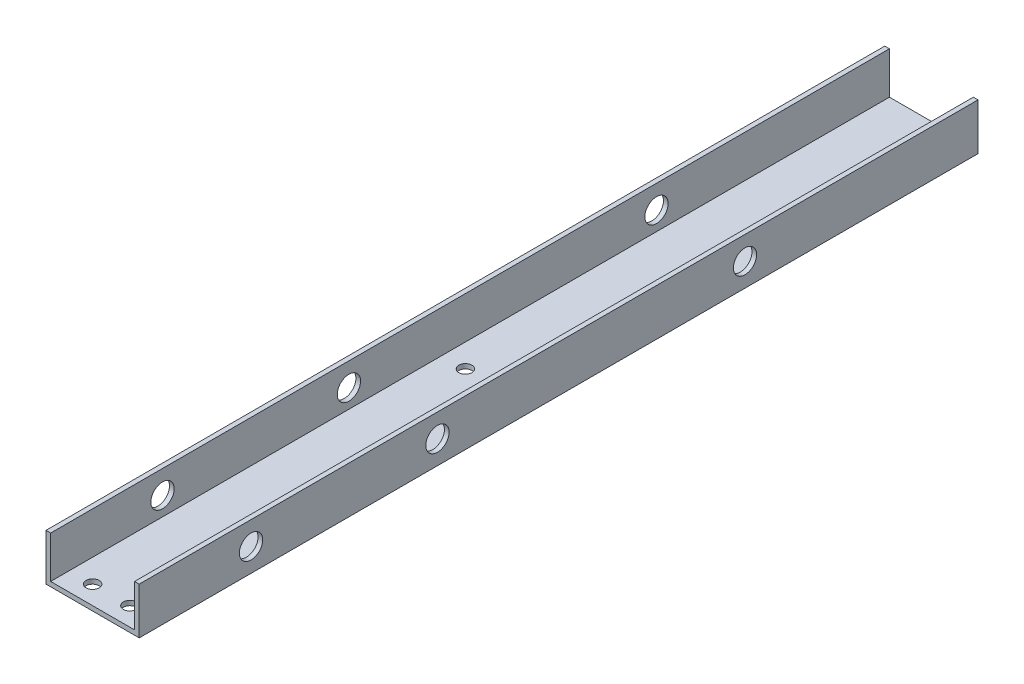
ISO-10303-21;
HEADER;
FILE_DESCRIPTION(('STEP AP214'),'2;1');
FILE_NAME('part.step','',(''),(''),'','','');
FILE_SCHEMA(('AUTOMOTIVE_DESIGN { 1 0 10303 214 1 1 1 1 }'));
ENDSEC;
DATA;
#1=APPLICATION_CONTEXT('core data for automotive mechanical design processes');
#2=APPLICATION_PROTOCOL_DEFINITION('international standard','automotive_design',2000,#1);
#3=PRODUCT_CONTEXT('',#1,'mechanical');
#4=PRODUCT('Part','Part','',(#3));
#5=PRODUCT_RELATED_PRODUCT_CATEGORY('part','',(#4));
#6=PRODUCT_DEFINITION_FORMATION('','',#4);
#7=PRODUCT_DEFINITION_CONTEXT('part definition',#1,'design');
#8=PRODUCT_DEFINITION('design','',#6,#7);
#9=PRODUCT_DEFINITION_SHAPE('','',#8);
#10=(LENGTH_UNIT() NAMED_UNIT(*) SI_UNIT(.MILLI.,.METRE.));
#11=(NAMED_UNIT(*) PLANE_ANGLE_UNIT() SI_UNIT($,.RADIAN.));
#12=(NAMED_UNIT(*) SI_UNIT($,.STERADIAN.) SOLID_ANGLE_UNIT());
#13=UNCERTAINTY_MEASURE_WITH_UNIT(LENGTH_MEASURE(1.E-05),#10,'distance_accuracy_value','');
#14=(GEOMETRIC_REPRESENTATION_CONTEXT(3) GLOBAL_UNCERTAINTY_ASSIGNED_CONTEXT((#13)) GLOBAL_UNIT_ASSIGNED_CONTEXT((#10,
#11,#12)) REPRESENTATION_CONTEXT('',''));
#15=CARTESIAN_POINT('',(0.,0.,0.));
#16=DIRECTION('',(0.,0.,1.));
#17=DIRECTION('',(1.,0.,0.));
#18=AXIS2_PLACEMENT_3D('',#15,#16,#17);
#19=CARTESIAN_POINT('',(0.,0.,457.2));
#20=DIRECTION('',(1.,0.,0.));
#21=DIRECTION('',(0.,0.,-1.));
#22=AXIS2_PLACEMENT_3D('',#19,#20,#21);
#23=PLANE('',#22);
#24=CARTESIAN_POINT('',(0.,12.7,396.24));
#25=DIRECTION('',(-1.,0.,0.));
#26=DIRECTION('',(0.,0.,1.));
#27=AXIS2_PLACEMENT_3D('',#24,#25,#26);
#28=CIRCLE('',#27,6.35);
#29=CARTESIAN_POINT('',(0.,12.7,402.59));
#30=VERTEX_POINT('',#29);
#31=EDGE_CURVE('E246',#30,#30,#28,.T.);
#32=ORIENTED_EDGE('',*,*,#31,.F.);
#33=EDGE_LOOP('',(#32));
#34=FACE_BOUND('',#33,.T.);
#35=CARTESIAN_POINT('',(0.,12.7,294.64));
#36=DIRECTION('',(-1.,0.,0.));
#37=DIRECTION('',(0.,0.,1.));
#38=AXIS2_PLACEMENT_3D('',#35,#36,#37);
#39=CIRCLE('',#38,6.35);
#40=CARTESIAN_POINT('',(0.,12.7,300.99));
#41=VERTEX_POINT('',#40);
#42=EDGE_CURVE('E250',#41,#41,#39,.T.);
#43=ORIENTED_EDGE('',*,*,#42,.F.);
#44=EDGE_LOOP('',(#43));
#45=FACE_BOUND('',#44,.T.);
#46=CARTESIAN_POINT('',(0.,12.6999999999999,127.));
#47=DIRECTION('',(-1.,0.,0.));
#48=DIRECTION('',(0.,0.,1.));
#49=AXIS2_PLACEMENT_3D('',#46,#47,#48);
#50=CIRCLE('',#49,6.35);
#51=CARTESIAN_POINT('',(0.,12.6999999999999,133.35));
#52=VERTEX_POINT('',#51);
#53=EDGE_CURVE('E173',#52,#52,#50,.T.);
#54=ORIENTED_EDGE('',*,*,#53,.F.);
#55=EDGE_LOOP('',(#54));
#56=FACE_BOUND('',#55,.T.);
#57=DIRECTION('',(0.,-1.,0.));
#58=VECTOR('',#57,1.);
#59=CARTESIAN_POINT('',(0.,0.,0.));
#60=LINE('',#59,#58);
#61=CARTESIAN_POINT('',(0.,25.4,0.));
#62=VERTEX_POINT('',#61);
#63=CARTESIAN_POINT('',(0.,0.,0.));
#64=VERTEX_POINT('',#63);
#65=EDGE_CURVE('E130',#62,#64,#60,.T.);
#66=ORIENTED_EDGE('',*,*,#65,.T.);
#67=DIRECTION('',(0.,0.,-1.));
#68=VECTOR('',#67,1.);
#69=CARTESIAN_POINT('',(0.,0.,457.2));
#70=LINE('',#69,#68);
#71=CARTESIAN_POINT('',(0.,0.,457.2));
#72=VERTEX_POINT('',#71);
#73=EDGE_CURVE('E11',#72,#64,#70,.T.);
#74=ORIENTED_EDGE('',*,*,#73,.F.);
#75=DIRECTION('',(0.,-1.,0.));
#76=VECTOR('',#75,1.);
#77=CARTESIAN_POINT('',(0.,0.,457.2));
#78=LINE('',#77,#76);
#79=CARTESIAN_POINT('',(0.,25.4,457.2));
#80=VERTEX_POINT('',#79);
#81=EDGE_CURVE('E145',#80,#72,#78,.T.);
#82=ORIENTED_EDGE('',*,*,#81,.F.);
#83=DIRECTION('',(0.,0.,-1.));
#84=VECTOR('',#83,1.);
#85=CARTESIAN_POINT('',(0.,25.4,457.2));
#86=LINE('',#85,#84);
#87=EDGE_CURVE('E126',#80,#62,#86,.T.);
#88=ORIENTED_EDGE('',*,*,#87,.T.);
#89=EDGE_LOOP('',(#66,#74,#82,#88));
#90=FACE_BOUND('',#89,.T.);
#91=ADVANCED_FACE('F32',(#34,#45,#56,#90),#23,.F.);
#92=CARTESIAN_POINT('',(0.,0.,457.2));
#93=DIRECTION('',(0.,1.,0.));
#94=DIRECTION('',(0.,0.,1.));
#95=AXIS2_PLACEMENT_3D('',#92,#93,#94);
#96=PLANE('',#95);
#97=CARTESIAN_POINT('',(15.24,0.,243.84));
#98=DIRECTION('',(0.,-1.,0.));
#99=DIRECTION('',(0.,0.,-1.));
#100=AXIS2_PLACEMENT_3D('',#97,#98,#99);
#101=CIRCLE('',#100,3.55599999999999);
#102=CARTESIAN_POINT('',(15.24,0.,240.284));
#103=VERTEX_POINT('',#102);
#104=EDGE_CURVE('E180',#103,#103,#101,.T.);
#105=ORIENTED_EDGE('',*,*,#104,.F.);
#106=EDGE_LOOP('',(#105));
#107=FACE_BOUND('',#106,.T.);
#108=CARTESIAN_POINT('',(35.56,0.,243.84));
#109=DIRECTION('',(0.,-1.,0.));
#110=DIRECTION('',(0.,0.,-1.));
#111=AXIS2_PLACEMENT_3D('',#108,#109,#110);
#112=CIRCLE('',#111,3.55599999999995);
#113=CARTESIAN_POINT('',(35.56,0.,240.284));
#114=VERTEX_POINT('',#113);
#115=EDGE_CURVE('E179',#114,#114,#112,.T.);
#116=ORIENTED_EDGE('',*,*,#115,.F.);
#117=EDGE_LOOP('',(#116));
#118=FACE_BOUND('',#117,.T.);
#119=CARTESIAN_POINT('',(15.24,0.,447.04));
#120=DIRECTION('',(0.,-1.,0.));
#121=DIRECTION('',(0.,0.,-1.));
#122=AXIS2_PLACEMENT_3D('',#119,#120,#121);
#123=CIRCLE('',#122,3.55599999999997);
#124=CARTESIAN_POINT('',(15.24,0.,443.484));
#125=VERTEX_POINT('',#124);
#126=EDGE_CURVE('E192',#125,#125,#123,.T.);
#127=ORIENTED_EDGE('',*,*,#126,.F.);
#128=EDGE_LOOP('',(#127));
#129=FACE_BOUND('',#128,.T.);
#130=CARTESIAN_POINT('',(35.56,0.,447.04));
#131=DIRECTION('',(0.,-1.,0.));
#132=DIRECTION('',(0.,0.,1.));
#133=AXIS2_PLACEMENT_3D('',#130,#131,#132);
#134=CIRCLE('',#133,3.55599999999997);
#135=CARTESIAN_POINT('',(35.56,0.,450.596));
#136=VERTEX_POINT('',#135);
#137=EDGE_CURVE('E187',#136,#136,#134,.T.);
#138=ORIENTED_EDGE('',*,*,#137,.F.);
#139=EDGE_LOOP('',(#138));
#140=FACE_BOUND('',#139,.T.);
#141=DIRECTION('',(1.,0.,0.));
#142=VECTOR('',#141,1.);
#143=CARTESIAN_POINT('',(0.,0.,0.));
#144=LINE('',#143,#142);
#145=CARTESIAN_POINT('',(50.8,0.,0.));
#146=VERTEX_POINT('',#145);
#147=EDGE_CURVE('E133',#64,#146,#144,.T.);
#148=ORIENTED_EDGE('',*,*,#147,.T.);
#149=DIRECTION('',(0.,0.,-1.));
#150=VECTOR('',#149,1.);
#151=CARTESIAN_POINT('',(50.8,0.,457.2));
#152=LINE('',#151,#150);
#153=CARTESIAN_POINT('',(50.8,0.,457.2));
#154=VERTEX_POINT('',#153);
#155=EDGE_CURVE('E41',#154,#146,#152,.T.);
#156=ORIENTED_EDGE('',*,*,#155,.F.);
#157=DIRECTION('',(1.,0.,0.));
#158=VECTOR('',#157,1.);
#159=CARTESIAN_POINT('',(0.,0.,457.2));
#160=LINE('',#159,#158);
#161=EDGE_CURVE('E93',#72,#154,#160,.T.);
#162=ORIENTED_EDGE('',*,*,#161,.F.);
#163=ORIENTED_EDGE('',*,*,#73,.T.);
#164=EDGE_LOOP('',(#148,#156,#162,#163));
#165=FACE_BOUND('',#164,.T.);
#166=ADVANCED_FACE('F236',(#107,#118,#129,#140,#165),#96,.F.);
#167=CARTESIAN_POINT('',(50.8,0.,457.2));
#168=DIRECTION('',(-1.,0.,0.));
#169=DIRECTION('',(0.,0.,1.));
#170=AXIS2_PLACEMENT_3D('',#167,#168,#169);
#171=PLANE('',#170);
#172=CARTESIAN_POINT('',(50.8,12.7,396.24));
#173=DIRECTION('',(-1.,0.,0.));
#174=DIRECTION('',(0.,0.,1.));
#175=AXIS2_PLACEMENT_3D('',#172,#173,#174);
#176=CIRCLE('',#175,6.35);
#177=CARTESIAN_POINT('',(50.8,12.7,402.59));
#178=VERTEX_POINT('',#177);
#179=EDGE_CURVE('E160',#178,#178,#176,.T.);
#180=ORIENTED_EDGE('',*,*,#179,.T.);
#181=EDGE_LOOP('',(#180));
#182=FACE_BOUND('',#181,.T.);
#183=CARTESIAN_POINT('',(50.8,12.7,294.64));
#184=DIRECTION('',(-1.,0.,0.));
#185=DIRECTION('',(0.,0.,1.));
#186=AXIS2_PLACEMENT_3D('',#183,#184,#185);
#187=CIRCLE('',#186,6.35);
#188=CARTESIAN_POINT('',(50.8,12.7,300.99));
#189=VERTEX_POINT('',#188);
#190=EDGE_CURVE('E258',#189,#189,#187,.T.);
#191=ORIENTED_EDGE('',*,*,#190,.T.);
#192=EDGE_LOOP('',(#191));
#193=FACE_BOUND('',#192,.T.);
#194=CARTESIAN_POINT('',(50.8,12.6999999999999,127.));
#195=DIRECTION('',(-1.,0.,0.));
#196=DIRECTION('',(0.,0.,1.));
#197=AXIS2_PLACEMENT_3D('',#194,#195,#196);
#198=CIRCLE('',#197,6.35);
#199=CARTESIAN_POINT('',(50.8,12.6999999999999,133.35));
#200=VERTEX_POINT('',#199);
#201=EDGE_CURVE('E254',#200,#200,#198,.T.);
#202=ORIENTED_EDGE('',*,*,#201,.T.);
#203=EDGE_LOOP('',(#202));
#204=FACE_BOUND('',#203,.T.);
#205=DIRECTION('',(0.,1.,0.));
#206=VECTOR('',#205,1.);
#207=CARTESIAN_POINT('',(50.8,0.,0.));
#208=LINE('',#207,#206);
#209=CARTESIAN_POINT('',(50.8,25.4,0.));
#210=VERTEX_POINT('',#209);
#211=EDGE_CURVE('E136',#146,#210,#208,.T.);
#212=ORIENTED_EDGE('',*,*,#211,.T.);
#213=DIRECTION('',(0.,0.,-1.));
#214=VECTOR('',#213,1.);
#215=CARTESIAN_POINT('',(50.8,25.4,457.2));
#216=LINE('',#215,#214);
#217=CARTESIAN_POINT('',(50.8,25.4,457.2));
#218=VERTEX_POINT('',#217);
#219=EDGE_CURVE('E152',#218,#210,#216,.T.);
#220=ORIENTED_EDGE('',*,*,#219,.F.);
#221=DIRECTION('',(0.,1.,0.));
#222=VECTOR('',#221,1.);
#223=CARTESIAN_POINT('',(50.8,0.,457.2));
#224=LINE('',#223,#222);
#225=EDGE_CURVE('E204',#154,#218,#224,.T.);
#226=ORIENTED_EDGE('',*,*,#225,.F.);
#227=ORIENTED_EDGE('',*,*,#155,.T.);
#228=EDGE_LOOP('',(#212,#220,#226,#227));
#229=FACE_BOUND('',#228,.T.);
#230=ADVANCED_FACE('F241',(#182,#193,#204,#229),#171,.F.);
#231=CARTESIAN_POINT('',(50.8,25.4,457.2));
#232=DIRECTION('',(0.,-1.,0.));
#233=DIRECTION('',(0.,0.,-1.));
#234=AXIS2_PLACEMENT_3D('',#231,#232,#233);
#235=PLANE('',#234);
#236=DIRECTION('',(-1.,0.,0.));
#237=VECTOR('',#236,1.);
#238=CARTESIAN_POINT('',(50.8,25.4,0.));
#239=LINE('',#238,#237);
#240=CARTESIAN_POINT('',(48.26,25.4,0.));
#241=VERTEX_POINT('',#240);
#242=EDGE_CURVE('E138',#210,#241,#239,.T.);
#243=ORIENTED_EDGE('',*,*,#242,.T.);
#244=DIRECTION('',(0.,0.,-1.));
#245=VECTOR('',#244,1.);
#246=CARTESIAN_POINT('',(48.26,25.4,457.2));
#247=LINE('',#246,#245);
#248=CARTESIAN_POINT('',(48.26,25.4,457.2));
#249=VERTEX_POINT('',#248);
#250=EDGE_CURVE('E149',#249,#241,#247,.T.);
#251=ORIENTED_EDGE('',*,*,#250,.F.);
#252=DIRECTION('',(-1.,0.,0.));
#253=VECTOR('',#252,1.);
#254=CARTESIAN_POINT('',(50.8,25.4,457.2));
#255=LINE('',#254,#253);
#256=EDGE_CURVE('E206',#218,#249,#255,.T.);
#257=ORIENTED_EDGE('',*,*,#256,.F.);
#258=ORIENTED_EDGE('',*,*,#219,.T.);
#259=EDGE_LOOP('',(#243,#251,#257,#258));
#260=FACE_BOUND('',#259,.T.);
#261=ADVANCED_FACE('F212',(#260),#235,.F.);
#262=CARTESIAN_POINT('',(48.26,2.54,457.2));
#263=DIRECTION('',(1.,0.,0.));
#264=DIRECTION('',(0.,0.,-1.));
#265=AXIS2_PLACEMENT_3D('',#262,#263,#264);
#266=PLANE('',#265);
#267=CARTESIAN_POINT('',(48.26,12.7,396.24));
#268=DIRECTION('',(1.,0.,0.));
#269=DIRECTION('',(0.,0.,-1.));
#270=AXIS2_PLACEMENT_3D('',#267,#268,#269);
#271=CIRCLE('',#270,6.35);
#272=CARTESIAN_POINT('',(48.26,12.7,389.89));
#273=VERTEX_POINT('',#272);
#274=EDGE_CURVE('E176',#273,#273,#271,.T.);
#275=ORIENTED_EDGE('',*,*,#274,.T.);
#276=EDGE_LOOP('',(#275));
#277=FACE_BOUND('',#276,.T.);
#278=CARTESIAN_POINT('',(48.26,12.7,294.64));
#279=DIRECTION('',(1.,0.,0.));
#280=DIRECTION('',(0.,0.,-1.));
#281=AXIS2_PLACEMENT_3D('',#278,#279,#280);
#282=CIRCLE('',#281,6.35);
#283=CARTESIAN_POINT('',(48.26,12.7,288.29));
#284=VERTEX_POINT('',#283);
#285=EDGE_CURVE('E163',#284,#284,#282,.T.);
#286=ORIENTED_EDGE('',*,*,#285,.T.);
#287=EDGE_LOOP('',(#286));
#288=FACE_BOUND('',#287,.T.);
#289=CARTESIAN_POINT('',(48.26,12.6999999999999,127.));
#290=DIRECTION('',(1.,0.,0.));
#291=DIRECTION('',(0.,0.,-1.));
#292=AXIS2_PLACEMENT_3D('',#289,#290,#291);
#293=CIRCLE('',#292,6.35);
#294=CARTESIAN_POINT('',(48.26,12.6999999999999,120.65));
#295=VERTEX_POINT('',#294);
#296=EDGE_CURVE('E159',#295,#295,#293,.T.);
#297=ORIENTED_EDGE('',*,*,#296,.T.);
#298=EDGE_LOOP('',(#297));
#299=FACE_BOUND('',#298,.T.);
#300=DIRECTION('',(0.,-1.,0.));
#301=VECTOR('',#300,1.);
#302=CARTESIAN_POINT('',(48.26,2.54,0.));
#303=LINE('',#302,#301);
#304=CARTESIAN_POINT('',(48.26,2.54,0.));
#305=VERTEX_POINT('',#304);
#306=EDGE_CURVE('E140',#241,#305,#303,.T.);
#307=ORIENTED_EDGE('',*,*,#306,.T.);
#308=DIRECTION('',(0.,0.,-1.));
#309=VECTOR('',#308,1.);
#310=CARTESIAN_POINT('',(48.26,2.54,457.2));
#311=LINE('',#310,#309);
#312=CARTESIAN_POINT('',(48.26,2.54,457.2));
#313=VERTEX_POINT('',#312);
#314=EDGE_CURVE('E121',#313,#305,#311,.T.);
#315=ORIENTED_EDGE('',*,*,#314,.F.);
#316=DIRECTION('',(0.,-1.,0.));
#317=VECTOR('',#316,1.);
#318=CARTESIAN_POINT('',(48.26,2.54,457.2));
#319=LINE('',#318,#317);
#320=EDGE_CURVE('E112',#249,#313,#319,.T.);
#321=ORIENTED_EDGE('',*,*,#320,.F.);
#322=ORIENTED_EDGE('',*,*,#250,.T.);
#323=EDGE_LOOP('',(#307,#315,#321,#322));
#324=FACE_BOUND('',#323,.T.);
#325=ADVANCED_FACE('F216',(#277,#288,#299,#324),#266,.F.);
#326=CARTESIAN_POINT('',(2.54,2.54,457.2));
#327=DIRECTION('',(0.,-1.,0.));
#328=DIRECTION('',(0.,0.,-1.));
#329=AXIS2_PLACEMENT_3D('',#326,#327,#328);
#330=PLANE('',#329);
#331=CARTESIAN_POINT('',(15.24,2.54,243.84));
#332=DIRECTION('',(0.,-1.,0.));
#333=DIRECTION('',(0.,0.,-1.));
#334=AXIS2_PLACEMENT_3D('',#331,#332,#333);
#335=CIRCLE('',#334,3.55599999999999);
#336=CARTESIAN_POINT('',(15.24,2.54,240.284));
#337=VERTEX_POINT('',#336);
#338=EDGE_CURVE('E183',#337,#337,#335,.F.);
#339=ORIENTED_EDGE('',*,*,#338,.F.);
#340=EDGE_LOOP('',(#339));
#341=FACE_BOUND('',#340,.T.);
#342=CARTESIAN_POINT('',(35.56,2.54,243.84));
#343=DIRECTION('',(0.,-1.,0.));
#344=DIRECTION('',(0.,0.,-1.));
#345=AXIS2_PLACEMENT_3D('',#342,#343,#344);
#346=CIRCLE('',#345,3.55599999999995);
#347=CARTESIAN_POINT('',(35.56,2.54,240.284));
#348=VERTEX_POINT('',#347);
#349=EDGE_CURVE('E184',#348,#348,#346,.F.);
#350=ORIENTED_EDGE('',*,*,#349,.F.);
#351=EDGE_LOOP('',(#350));
#352=FACE_BOUND('',#351,.T.);
#353=CARTESIAN_POINT('',(15.24,2.54,447.04));
#354=DIRECTION('',(0.,-1.,0.));
#355=DIRECTION('',(0.,0.,-1.));
#356=AXIS2_PLACEMENT_3D('',#353,#354,#355);
#357=CIRCLE('',#356,3.55599999999997);
#358=CARTESIAN_POINT('',(15.24,2.54,443.484));
#359=VERTEX_POINT('',#358);
#360=EDGE_CURVE('E134',#359,#359,#357,.F.);
#361=ORIENTED_EDGE('',*,*,#360,.F.);
#362=EDGE_LOOP('',(#361));
#363=FACE_BOUND('',#362,.T.);
#364=CARTESIAN_POINT('',(35.56,2.54,447.04));
#365=DIRECTION('',(0.,-1.,0.));
#366=DIRECTION('',(0.,0.,-1.));
#367=AXIS2_PLACEMENT_3D('',#364,#365,#366);
#368=CIRCLE('',#367,3.55599999999997);
#369=CARTESIAN_POINT('',(35.56,2.54,443.484));
#370=VERTEX_POINT('',#369);
#371=EDGE_CURVE('E195',#370,#370,#368,.F.);
#372=ORIENTED_EDGE('',*,*,#371,.F.);
#373=EDGE_LOOP('',(#372));
#374=FACE_BOUND('',#373,.T.);
#375=DIRECTION('',(-1.,0.,0.));
#376=VECTOR('',#375,1.);
#377=CARTESIAN_POINT('',(2.54,2.54,0.));
#378=LINE('',#377,#376);
#379=CARTESIAN_POINT('',(2.54,2.54,0.));
#380=VERTEX_POINT('',#379);
#381=EDGE_CURVE('E120',#305,#380,#378,.T.);
#382=ORIENTED_EDGE('',*,*,#381,.T.);
#383=DIRECTION('',(0.,0.,-1.));
#384=VECTOR('',#383,1.);
#385=CARTESIAN_POINT('',(2.54,2.54,457.2));
#386=LINE('',#385,#384);
#387=CARTESIAN_POINT('',(2.54,2.54,457.2));
#388=VERTEX_POINT('',#387);
#389=EDGE_CURVE('E117',#388,#380,#386,.T.);
#390=ORIENTED_EDGE('',*,*,#389,.F.);
#391=DIRECTION('',(-1.,0.,0.));
#392=VECTOR('',#391,1.);
#393=CARTESIAN_POINT('',(2.54,2.54,457.2));
#394=LINE('',#393,#392);
#395=EDGE_CURVE('E106',#313,#388,#394,.T.);
#396=ORIENTED_EDGE('',*,*,#395,.F.);
#397=ORIENTED_EDGE('',*,*,#314,.T.);
#398=EDGE_LOOP('',(#382,#390,#396,#397));
#399=FACE_BOUND('',#398,.T.);
#400=ADVANCED_FACE('F118',(#341,#352,#363,#374,#399),#330,.F.);
#401=CARTESIAN_POINT('',(2.54,2.54,457.2));
#402=DIRECTION('',(-1.,0.,0.));
#403=DIRECTION('',(0.,0.,1.));
#404=AXIS2_PLACEMENT_3D('',#401,#402,#403);
#405=PLANE('',#404);
#406=CARTESIAN_POINT('',(2.54,12.7,396.24));
#407=DIRECTION('',(-1.,0.,0.));
#408=DIRECTION('',(0.,0.,1.));
#409=AXIS2_PLACEMENT_3D('',#406,#407,#408);
#410=CIRCLE('',#409,6.35);
#411=CARTESIAN_POINT('',(2.54,12.7,402.59));
#412=VERTEX_POINT('',#411);
#413=EDGE_CURVE('E35',#412,#412,#410,.T.);
#414=ORIENTED_EDGE('',*,*,#413,.T.);
#415=EDGE_LOOP('',(#414));
#416=FACE_BOUND('',#415,.T.);
#417=CARTESIAN_POINT('',(2.54,12.7,294.64));
#418=DIRECTION('',(-1.,0.,0.));
#419=DIRECTION('',(0.,0.,1.));
#420=AXIS2_PLACEMENT_3D('',#417,#418,#419);
#421=CIRCLE('',#420,6.35);
#422=CARTESIAN_POINT('',(2.54,12.7,300.99));
#423=VERTEX_POINT('',#422);
#424=EDGE_CURVE('E161',#423,#423,#421,.T.);
#425=ORIENTED_EDGE('',*,*,#424,.T.);
#426=EDGE_LOOP('',(#425));
#427=FACE_BOUND('',#426,.T.);
#428=CARTESIAN_POINT('',(2.54,12.6999999999999,127.));
#429=DIRECTION('',(-1.,0.,0.));
#430=DIRECTION('',(0.,0.,1.));
#431=AXIS2_PLACEMENT_3D('',#428,#429,#430);
#432=CIRCLE('',#431,6.35);
#433=CARTESIAN_POINT('',(2.54,12.6999999999999,133.35));
#434=VERTEX_POINT('',#433);
#435=EDGE_CURVE('E157',#434,#434,#432,.T.);
#436=ORIENTED_EDGE('',*,*,#435,.T.);
#437=EDGE_LOOP('',(#436));
#438=FACE_BOUND('',#437,.T.);
#439=DIRECTION('',(0.,1.,0.));
#440=VECTOR('',#439,1.);
#441=CARTESIAN_POINT('',(2.54,2.54,0.));
#442=LINE('',#441,#440);
#443=CARTESIAN_POINT('',(2.54,25.4,0.));
#444=VERTEX_POINT('',#443);
#445=EDGE_CURVE('E79',#380,#444,#442,.T.);
#446=ORIENTED_EDGE('',*,*,#445,.T.);
#447=DIRECTION('',(0.,0.,-1.));
#448=VECTOR('',#447,1.);
#449=CARTESIAN_POINT('',(2.54,25.4,457.2));
#450=LINE('',#449,#448);
#451=CARTESIAN_POINT('',(2.54,25.4,457.2));
#452=VERTEX_POINT('',#451);
#453=EDGE_CURVE('E122',#452,#444,#450,.T.);
#454=ORIENTED_EDGE('',*,*,#453,.F.);
#455=DIRECTION('',(0.,1.,0.));
#456=VECTOR('',#455,1.);
#457=CARTESIAN_POINT('',(2.54,2.54,457.2));
#458=LINE('',#457,#456);
#459=EDGE_CURVE('E110',#388,#452,#458,.T.);
#460=ORIENTED_EDGE('',*,*,#459,.F.);
#461=ORIENTED_EDGE('',*,*,#389,.T.);
#462=EDGE_LOOP('',(#446,#454,#460,#461));
#463=FACE_BOUND('',#462,.T.);
#464=ADVANCED_FACE('F124',(#416,#427,#438,#463),#405,.F.);
#465=CARTESIAN_POINT('',(0.,25.4,457.2));
#466=DIRECTION('',(0.,-1.,0.));
#467=DIRECTION('',(0.,0.,-1.));
#468=AXIS2_PLACEMENT_3D('',#465,#466,#467);
#469=PLANE('',#468);
#470=DIRECTION('',(-1.,0.,0.));
#471=VECTOR('',#470,1.);
#472=CARTESIAN_POINT('',(0.,25.4,0.));
#473=LINE('',#472,#471);
#474=EDGE_CURVE('E85',#444,#62,#473,.T.);
#475=ORIENTED_EDGE('',*,*,#474,.T.);
#476=ORIENTED_EDGE('',*,*,#87,.F.);
#477=DIRECTION('',(-1.,0.,0.));
#478=VECTOR('',#477,1.);
#479=CARTESIAN_POINT('',(0.,25.4,457.2));
#480=LINE('',#479,#478);
#481=EDGE_CURVE('E50',#452,#80,#480,.T.);
#482=ORIENTED_EDGE('',*,*,#481,.F.);
#483=ORIENTED_EDGE('',*,*,#453,.T.);
#484=EDGE_LOOP('',(#475,#476,#482,#483));
#485=FACE_BOUND('',#484,.T.);
#486=ADVANCED_FACE('F224',(#485),#469,.F.);
#487=CARTESIAN_POINT('',(0.,0.,457.2));
#488=DIRECTION('',(0.,0.,-1.));
#489=DIRECTION('',(-1.,0.,0.));
#490=AXIS2_PLACEMENT_3D('',#487,#488,#489);
#491=PLANE('',#490);
#492=ORIENTED_EDGE('',*,*,#81,.T.);
#493=ORIENTED_EDGE('',*,*,#161,.T.);
#494=ORIENTED_EDGE('',*,*,#225,.T.);
#495=ORIENTED_EDGE('',*,*,#256,.T.);
#496=ORIENTED_EDGE('',*,*,#320,.T.);
#497=ORIENTED_EDGE('',*,*,#395,.T.);
#498=ORIENTED_EDGE('',*,*,#459,.T.);
#499=ORIENTED_EDGE('',*,*,#481,.T.);
#500=EDGE_LOOP('',(#492,#493,#494,#495,#496,#497,#498,#499));
#501=FACE_BOUND('',#500,.T.);
#502=ADVANCED_FACE('F108',(#501),#491,.F.);
#503=CARTESIAN_POINT('',(0.,0.,0.));
#504=DIRECTION('',(0.,0.,-1.));
#505=DIRECTION('',(-1.,0.,0.));
#506=AXIS2_PLACEMENT_3D('',#503,#504,#505);
#507=PLANE('',#506);
#508=ORIENTED_EDGE('',*,*,#65,.F.);
#509=ORIENTED_EDGE('',*,*,#474,.F.);
#510=ORIENTED_EDGE('',*,*,#445,.F.);
#511=ORIENTED_EDGE('',*,*,#381,.F.);
#512=ORIENTED_EDGE('',*,*,#306,.F.);
#513=ORIENTED_EDGE('',*,*,#242,.F.);
#514=ORIENTED_EDGE('',*,*,#211,.F.);
#515=ORIENTED_EDGE('',*,*,#147,.F.);
#516=EDGE_LOOP('',(#508,#509,#510,#511,#512,#513,#514,#515));
#517=FACE_BOUND('',#516,.T.);
#518=ADVANCED_FACE('F219',(#517),#507,.T.);
#519=CARTESIAN_POINT('',(35.56,25.401,447.04));
#520=DIRECTION('',(0.,-1.,0.));
#521=DIRECTION('',(0.,0.,-1.));
#522=AXIS2_PLACEMENT_3D('',#519,#520,#521);
#523=CYLINDRICAL_SURFACE('',#522,3.55599999999997);
#524=ORIENTED_EDGE('',*,*,#137,.T.);
#525=EDGE_LOOP('',(#524));
#526=FACE_BOUND('',#525,.T.);
#527=ORIENTED_EDGE('',*,*,#371,.T.);
#528=EDGE_LOOP('',(#527));
#529=FACE_BOUND('',#528,.T.);
#530=ADVANCED_FACE('F317',(#526,#529),#523,.F.);
#531=CARTESIAN_POINT('',(15.24,25.401,447.04));
#532=DIRECTION('',(0.,-1.,0.));
#533=DIRECTION('',(0.,0.,-1.));
#534=AXIS2_PLACEMENT_3D('',#531,#532,#533);
#535=CYLINDRICAL_SURFACE('',#534,3.55599999999997);
#536=ORIENTED_EDGE('',*,*,#126,.T.);
#537=EDGE_LOOP('',(#536));
#538=FACE_BOUND('',#537,.T.);
#539=ORIENTED_EDGE('',*,*,#360,.T.);
#540=EDGE_LOOP('',(#539));
#541=FACE_BOUND('',#540,.T.);
#542=ADVANCED_FACE('F313',(#538,#541),#535,.F.);
#543=CARTESIAN_POINT('',(35.56,25.401,243.84));
#544=DIRECTION('',(0.,-1.,0.));
#545=DIRECTION('',(0.,0.,-1.));
#546=AXIS2_PLACEMENT_3D('',#543,#544,#545);
#547=CYLINDRICAL_SURFACE('',#546,3.55599999999995);
#548=ORIENTED_EDGE('',*,*,#115,.T.);
#549=EDGE_LOOP('',(#548));
#550=FACE_BOUND('',#549,.T.);
#551=ORIENTED_EDGE('',*,*,#349,.T.);
#552=EDGE_LOOP('',(#551));
#553=FACE_BOUND('',#552,.T.);
#554=ADVANCED_FACE('F306',(#550,#553),#547,.F.);
#555=CARTESIAN_POINT('',(15.24,25.401,243.84));
#556=DIRECTION('',(0.,-1.,0.));
#557=DIRECTION('',(0.,0.,-1.));
#558=AXIS2_PLACEMENT_3D('',#555,#556,#557);
#559=CYLINDRICAL_SURFACE('',#558,3.55599999999999);
#560=ORIENTED_EDGE('',*,*,#104,.T.);
#561=EDGE_LOOP('',(#560));
#562=FACE_BOUND('',#561,.T.);
#563=ORIENTED_EDGE('',*,*,#338,.T.);
#564=EDGE_LOOP('',(#563));
#565=FACE_BOUND('',#564,.T.);
#566=ADVANCED_FACE('F301',(#562,#565),#559,.F.);
#567=CARTESIAN_POINT('',(50.8,12.6999999999999,127.));
#568=DIRECTION('',(-1.,0.,0.));
#569=DIRECTION('',(0.,0.,1.));
#570=AXIS2_PLACEMENT_3D('',#567,#568,#569);
#571=CYLINDRICAL_SURFACE('',#570,6.35);
#572=ORIENTED_EDGE('',*,*,#53,.T.);
#573=EDGE_LOOP('',(#572));
#574=FACE_BOUND('',#573,.T.);
#575=ORIENTED_EDGE('',*,*,#435,.F.);
#576=EDGE_LOOP('',(#575));
#577=FACE_BOUND('',#576,.T.);
#578=ADVANCED_FACE('F292',(#574,#577),#571,.F.);
#579=CARTESIAN_POINT('',(50.8,12.7,294.64));
#580=DIRECTION('',(-1.,0.,0.));
#581=DIRECTION('',(0.,0.,1.));
#582=AXIS2_PLACEMENT_3D('',#579,#580,#581);
#583=CYLINDRICAL_SURFACE('',#582,6.35);
#584=ORIENTED_EDGE('',*,*,#42,.T.);
#585=EDGE_LOOP('',(#584));
#586=FACE_BOUND('',#585,.T.);
#587=ORIENTED_EDGE('',*,*,#424,.F.);
#588=EDGE_LOOP('',(#587));
#589=FACE_BOUND('',#588,.T.);
#590=ADVANCED_FACE('F286',(#586,#589),#583,.F.);
#591=CARTESIAN_POINT('',(50.8,12.7,396.24));
#592=DIRECTION('',(-1.,0.,0.));
#593=DIRECTION('',(0.,0.,1.));
#594=AXIS2_PLACEMENT_3D('',#591,#592,#593);
#595=CYLINDRICAL_SURFACE('',#594,6.35);
#596=ORIENTED_EDGE('',*,*,#31,.T.);
#597=EDGE_LOOP('',(#596));
#598=FACE_BOUND('',#597,.T.);
#599=ORIENTED_EDGE('',*,*,#413,.F.);
#600=EDGE_LOOP('',(#599));
#601=FACE_BOUND('',#600,.T.);
#602=ADVANCED_FACE('F274',(#598,#601),#595,.F.);
#603=ORIENTED_EDGE('',*,*,#201,.F.);
#604=EDGE_LOOP('',(#603));
#605=FACE_BOUND('',#604,.T.);
#606=ORIENTED_EDGE('',*,*,#296,.F.);
#607=EDGE_LOOP('',(#606));
#608=FACE_BOUND('',#607,.T.);
#609=ADVANCED_FACE('F283',(#605,#608),#571,.F.);
#610=ORIENTED_EDGE('',*,*,#190,.F.);
#611=EDGE_LOOP('',(#610));
#612=FACE_BOUND('',#611,.T.);
#613=ORIENTED_EDGE('',*,*,#285,.F.);
#614=EDGE_LOOP('',(#613));
#615=FACE_BOUND('',#614,.T.);
#616=ADVANCED_FACE('F272',(#612,#615),#583,.F.);
#617=ORIENTED_EDGE('',*,*,#179,.F.);
#618=EDGE_LOOP('',(#617));
#619=FACE_BOUND('',#618,.T.);
#620=ORIENTED_EDGE('',*,*,#274,.F.);
#621=EDGE_LOOP('',(#620));
#622=FACE_BOUND('',#621,.T.);
#623=ADVANCED_FACE('F269',(#619,#622),#595,.F.);
#624=CLOSED_SHELL('',(#91,#166,#230,#261,#325,#400,#464,#486,#502,#518,#530,#542,#554,#566,#578,
#590,#602,#609,#616,#623));
#625=MANIFOLD_SOLID_BREP('B2',#624);
#626=ADVANCED_BREP_SHAPE_REPRESENTATION('',(#18,#625),#14);
#627=SHAPE_DEFINITION_REPRESENTATION(#9,#626);
ENDSEC;
END-ISO-10303-21;
